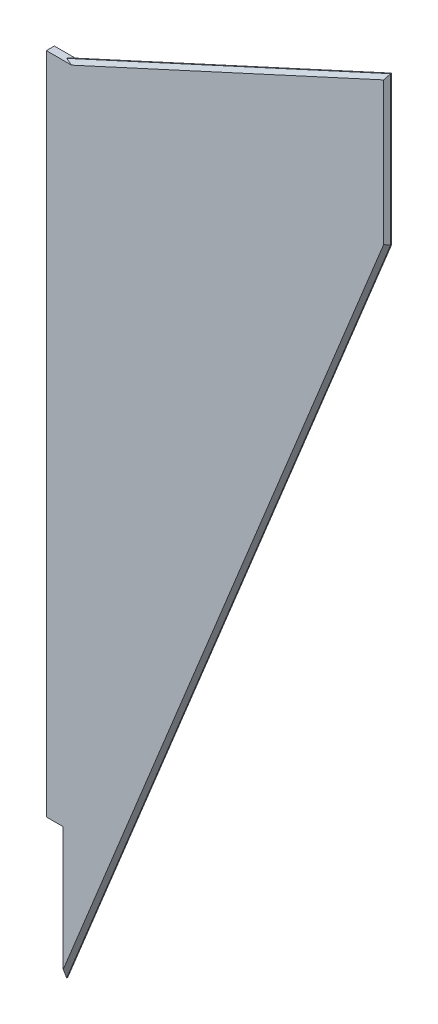
ISO-10303-21;
HEADER;
FILE_DESCRIPTION(('STEP AP214'),'2;1');
FILE_NAME('part.step','',(''),(''),'','','');
FILE_SCHEMA(('AUTOMOTIVE_DESIGN { 1 0 10303 214 1 1 1 1 }'));
ENDSEC;
DATA;
#1=APPLICATION_CONTEXT('core data for automotive mechanical design processes');
#2=APPLICATION_PROTOCOL_DEFINITION('international standard','automotive_design',2000,#1);
#3=PRODUCT_CONTEXT('',#1,'mechanical');
#4=PRODUCT('Part','Part','',(#3));
#5=PRODUCT_RELATED_PRODUCT_CATEGORY('part','',(#4));
#6=PRODUCT_DEFINITION_FORMATION('','',#4);
#7=PRODUCT_DEFINITION_CONTEXT('part definition',#1,'design');
#8=PRODUCT_DEFINITION('design','',#6,#7);
#9=PRODUCT_DEFINITION_SHAPE('','',#8);
#10=(LENGTH_UNIT() NAMED_UNIT(*) SI_UNIT(.MILLI.,.METRE.));
#11=(NAMED_UNIT(*) PLANE_ANGLE_UNIT() SI_UNIT($,.RADIAN.));
#12=(NAMED_UNIT(*) SI_UNIT($,.STERADIAN.) SOLID_ANGLE_UNIT());
#13=UNCERTAINTY_MEASURE_WITH_UNIT(LENGTH_MEASURE(1.E-05),#10,'distance_accuracy_value','');
#14=(GEOMETRIC_REPRESENTATION_CONTEXT(3) GLOBAL_UNCERTAINTY_ASSIGNED_CONTEXT((#13)) GLOBAL_UNIT_ASSIGNED_CONTEXT((#10,
#11,#12)) REPRESENTATION_CONTEXT('',''));
#15=CARTESIAN_POINT('',(0.,0.,0.));
#16=DIRECTION('',(0.,0.,1.));
#17=DIRECTION('',(1.,0.,0.));
#18=AXIS2_PLACEMENT_3D('',#15,#16,#17);
#19=CARTESIAN_POINT('',(59.9812470693966,2660.,3.));
#20=DIRECTION('',(1.,0.,0.));
#21=DIRECTION('',(0.,0.,-1.));
#22=AXIS2_PLACEMENT_3D('',#19,#20,#21);
#23=PLANE('',#22);
#24=DIRECTION('',(0.,-1.,0.));
#25=VECTOR('',#24,1.);
#26=CARTESIAN_POINT('',(59.9812470693966,2660.,0.));
#27=LINE('',#26,#25);
#28=CARTESIAN_POINT('',(59.9812470693966,2409.95388623622,0.));
#29=VERTEX_POINT('',#28);
#30=CARTESIAN_POINT('',(59.9812470693966,2363.40483206936,0.));
#31=VERTEX_POINT('',#30);
#32=EDGE_CURVE('E152',#29,#31,#27,.T.);
#33=ORIENTED_EDGE('',*,*,#32,.T.);
#34=DIRECTION('',(0.,0.935802545616209,-0.352524602855208));
#35=VECTOR('',#34,1.);
#36=CARTESIAN_POINT('',(59.9812470693966,2359.95388623622,1.29999999999991));
#37=LINE('',#36,#35);
#38=CARTESIAN_POINT('',(59.9812470693966,2359.95388623622,1.29999999999988));
#39=VERTEX_POINT('',#38);
#40=EDGE_CURVE('E200',#31,#39,#37,.F.);
#41=ORIENTED_EDGE('',*,*,#40,.T.);
#42=DIRECTION('',(0.,0.,-1.));
#43=VECTOR('',#42,1.);
#44=CARTESIAN_POINT('',(59.9812470693966,2359.95388623622,3.));
#45=LINE('',#44,#43);
#46=CARTESIAN_POINT('',(59.9812470693966,2359.95388623622,1.70000000000008));
#47=VERTEX_POINT('',#46);
#48=EDGE_CURVE('E179',#47,#39,#45,.T.);
#49=ORIENTED_EDGE('',*,*,#48,.F.);
#50=DIRECTION('',(0.,0.935802545616199,0.352524602855235));
#51=VECTOR('',#50,1.);
#52=CARTESIAN_POINT('',(59.9812470693967,569.087914954843,-672.934107644164));
#53=LINE('',#52,#51);
#54=CARTESIAN_POINT('',(59.9812470693966,2363.40483206936,3.));
#55=VERTEX_POINT('',#54);
#56=EDGE_CURVE('E197',#47,#55,#53,.T.);
#57=ORIENTED_EDGE('',*,*,#56,.T.);
#58=DIRECTION('',(0.,-1.,0.));
#59=VECTOR('',#58,1.);
#60=CARTESIAN_POINT('',(59.9812470693966,2660.,3.));
#61=LINE('',#60,#59);
#62=CARTESIAN_POINT('',(59.9812470693966,2409.95388623622,3.));
#63=VERTEX_POINT('',#62);
#64=EDGE_CURVE('E165',#63,#55,#61,.T.);
#65=ORIENTED_EDGE('',*,*,#64,.F.);
#66=DIRECTION('',(0.,0.,1.));
#67=VECTOR('',#66,1.);
#68=CARTESIAN_POINT('',(59.9812470693966,2409.95388623622,0.));
#69=LINE('',#68,#67);
#70=EDGE_CURVE('E146',#29,#63,#69,.T.);
#71=ORIENTED_EDGE('',*,*,#70,.F.);
#72=EDGE_LOOP('',(#33,#41,#49,#57,#65,#71));
#73=FACE_BOUND('',#72,.T.);
#74=ADVANCED_FACE('F40',(#73),#23,.F.);
#75=CARTESIAN_POINT('',(182.,2716.,3.));
#76=DIRECTION('',(0.417167660330651,-0.908829545720346,0.));
#77=DIRECTION('',(0.908829545720346,0.417167660330651,0.));
#78=AXIS2_PLACEMENT_3D('',#75,#76,#77);
#79=PLANE('',#78);
#80=DIRECTION('',(0.,0.,-1.));
#81=VECTOR('',#80,1.);
#82=CARTESIAN_POINT('',(182.,2716.,3.));
#83=LINE('',#82,#81);
#84=CARTESIAN_POINT('',(182.,2716.,1.69999999999981));
#85=VERTEX_POINT('',#84);
#86=CARTESIAN_POINT('',(182.,2716.,1.29999999999981));
#87=VERTEX_POINT('',#86);
#88=EDGE_CURVE('E168',#85,#87,#83,.T.);
#89=ORIENTED_EDGE('',*,*,#88,.T.);
#90=DIRECTION('',(-0.908829545720346,-0.417167660330651,0.));
#91=VECTOR('',#90,1.);
#92=CARTESIAN_POINT('',(182.,2716.,1.29999999999981));
#93=LINE('',#92,#91);
#94=CARTESIAN_POINT('',(60.,2660.,1.29999999999981));
#95=VERTEX_POINT('',#94);
#96=EDGE_CURVE('E210',#87,#95,#93,.T.);
#97=ORIENTED_EDGE('',*,*,#96,.T.);
#98=DIRECTION('',(0.,0.,-1.));
#99=VECTOR('',#98,1.);
#100=CARTESIAN_POINT('',(60.,2660.,3.));
#101=LINE('',#100,#99);
#102=CARTESIAN_POINT('',(60.,2660.,1.69999999999981));
#103=VERTEX_POINT('',#102);
#104=EDGE_CURVE('E183',#103,#95,#101,.T.);
#105=ORIENTED_EDGE('',*,*,#104,.F.);
#106=DIRECTION('',(0.908829545720346,0.417167660330651,0.));
#107=VECTOR('',#106,1.);
#108=CARTESIAN_POINT('',(182.,2716.,1.69999999999981));
#109=LINE('',#108,#107);
#110=EDGE_CURVE('E206',#103,#85,#109,.T.);
#111=ORIENTED_EDGE('',*,*,#110,.T.);
#112=EDGE_LOOP('',(#89,#97,#105,#111));
#113=FACE_BOUND('',#112,.T.);
#114=ADVANCED_FACE('F254',(#113),#79,.F.);
#115=CARTESIAN_POINT('',(60.,2660.,3.));
#116=DIRECTION('',(0.,-1.,0.));
#117=DIRECTION('',(0.,0.,-1.));
#118=AXIS2_PLACEMENT_3D('',#115,#116,#117);
#119=PLANE('',#118);
#120=DIRECTION('',(-1.,0.,0.));
#121=VECTOR('',#120,1.);
#122=CARTESIAN_POINT('',(60.,2660.,0.));
#123=LINE('',#122,#121);
#124=CARTESIAN_POINT('',(63.1162530647008,2660.,0.));
#125=VERTEX_POINT('',#124);
#126=CARTESIAN_POINT('',(53.6312470693966,2660.,0.));
#127=VERTEX_POINT('',#126);
#128=EDGE_CURVE('E154',#125,#127,#123,.T.);
#129=ORIENTED_EDGE('',*,*,#128,.T.);
#130=DIRECTION('',(0.,0.,-1.));
#131=VECTOR('',#130,1.);
#132=CARTESIAN_POINT('',(53.6312470693966,2660.,0.));
#133=LINE('',#132,#131);
#134=CARTESIAN_POINT('',(53.6312470693966,2660.,3.));
#135=VERTEX_POINT('',#134);
#136=EDGE_CURVE('E143',#135,#127,#133,.T.);
#137=ORIENTED_EDGE('',*,*,#136,.F.);
#138=DIRECTION('',(-1.,0.,0.));
#139=VECTOR('',#138,1.);
#140=CARTESIAN_POINT('',(60.,2660.,3.));
#141=LINE('',#140,#139);
#142=CARTESIAN_POINT('',(63.1162530647032,2660.,3.));
#143=VERTEX_POINT('',#142);
#144=EDGE_CURVE('E162',#143,#135,#141,.T.);
#145=ORIENTED_EDGE('',*,*,#144,.F.);
#146=DIRECTION('',(-0.922912682762478,0.,-0.385009324557425));
#147=VECTOR('',#146,1.);
#148=CARTESIAN_POINT('',(60.4619289852007,2660.,1.8927018339948));
#149=LINE('',#148,#147);
#150=EDGE_CURVE('E224',#143,#103,#149,.T.);
#151=ORIENTED_EDGE('',*,*,#150,.T.);
#152=ORIENTED_EDGE('',*,*,#104,.T.);
#153=DIRECTION('',(-0.922912682762414,0.,0.385009324557579));
#154=VECTOR('',#153,1.);
#155=CARTESIAN_POINT('',(59.3959390193528,2660.,1.55199470599352));
#156=LINE('',#155,#154);
#157=EDGE_CURVE('E220',#95,#125,#156,.F.);
#158=ORIENTED_EDGE('',*,*,#157,.T.);
#159=EDGE_LOOP('',(#129,#137,#145,#151,#152,#158));
#160=FACE_BOUND('',#159,.T.);
#161=ADVANCED_FACE('F282',(#160),#119,.F.);
#162=CARTESIAN_POINT('',(59.9812470693966,2359.95388623622,3.));
#163=DIRECTION('',(-0.926331929287375,0.376708317910197,0.));
#164=DIRECTION('',(-0.376708317910197,-0.926331929287375,0.));
#165=AXIS2_PLACEMENT_3D('',#162,#163,#164);
#166=PLANE('',#165);
#167=ORIENTED_EDGE('',*,*,#48,.T.);
#168=DIRECTION('',(0.376708317910197,0.926331929287375,0.));
#169=VECTOR('',#168,1.);
#170=CARTESIAN_POINT('',(59.9812470693966,2359.95388623622,1.29999999999988));
#171=LINE('',#170,#169);
#172=CARTESIAN_POINT('',(182.,2660.,1.29999999999988));
#173=VERTEX_POINT('',#172);
#174=EDGE_CURVE('E190',#39,#173,#171,.T.);
#175=ORIENTED_EDGE('',*,*,#174,.T.);
#176=DIRECTION('',(0.,0.,-1.));
#177=VECTOR('',#176,1.);
#178=CARTESIAN_POINT('',(182.,2660.,3.));
#179=LINE('',#178,#177);
#180=CARTESIAN_POINT('',(182.,2660.,1.70000000000008));
#181=VERTEX_POINT('',#180);
#182=EDGE_CURVE('E175',#181,#173,#179,.T.);
#183=ORIENTED_EDGE('',*,*,#182,.F.);
#184=DIRECTION('',(-0.376708317910197,-0.926331929287375,0.));
#185=VECTOR('',#184,1.);
#186=CARTESIAN_POINT('',(59.9812470693966,2359.95388623622,1.70000000000008));
#187=LINE('',#186,#185);
#188=EDGE_CURVE('E187',#181,#47,#187,.T.);
#189=ORIENTED_EDGE('',*,*,#188,.T.);
#190=EDGE_LOOP('',(#167,#175,#183,#189));
#191=FACE_BOUND('',#190,.T.);
#192=ADVANCED_FACE('F270',(#191),#166,.F.);
#193=CARTESIAN_POINT('',(182.,2660.,3.));
#194=DIRECTION('',(-1.,0.,0.));
#195=DIRECTION('',(0.,0.,1.));
#196=AXIS2_PLACEMENT_3D('',#193,#194,#195);
#197=PLANE('',#196);
#198=ORIENTED_EDGE('',*,*,#182,.T.);
#199=DIRECTION('',(0.,1.,0.));
#200=VECTOR('',#199,1.);
#201=CARTESIAN_POINT('',(182.,2660.,1.29999999999991));
#202=LINE('',#201,#200);
#203=EDGE_CURVE('E230',#173,#87,#202,.T.);
#204=ORIENTED_EDGE('',*,*,#203,.T.);
#205=ORIENTED_EDGE('',*,*,#88,.F.);
#206=DIRECTION('',(0.,-1.,0.));
#207=VECTOR('',#206,1.);
#208=CARTESIAN_POINT('',(182.,2663.45094583314,1.69999999999998));
#209=LINE('',#208,#207);
#210=EDGE_CURVE('E227',#85,#181,#209,.T.);
#211=ORIENTED_EDGE('',*,*,#210,.T.);
#212=EDGE_LOOP('',(#198,#204,#205,#211));
#213=FACE_BOUND('',#212,.T.);
#214=ADVANCED_FACE('F257',(#213),#197,.F.);
#215=CARTESIAN_POINT('',(0.,0.,3.));
#216=DIRECTION('',(0.,0.,1.));
#217=DIRECTION('',(1.,0.,0.));
#218=AXIS2_PLACEMENT_3D('',#215,#216,#217);
#219=PLANE('',#218);
#220=DIRECTION('',(0.376708317910197,0.926331929287375,0.));
#221=VECTOR('',#220,1.);
#222=CARTESIAN_POINT('',(180.795768491927,2660.48972081328,3.));
#223=LINE('',#222,#221);
#224=CARTESIAN_POINT('',(180.7,2660.25422452166,3.));
#225=VERTEX_POINT('',#224);
#226=EDGE_CURVE('E203',#55,#225,#223,.T.);
#227=ORIENTED_EDGE('',*,*,#226,.T.);
#228=DIRECTION('',(0.,1.,0.));
#229=VECTOR('',#228,1.);
#230=CARTESIAN_POINT('',(180.7,2714.56958875719,3.));
#231=LINE('',#230,#229);
#232=CARTESIAN_POINT('',(180.7,2713.97286744571,3.));
#233=VERTEX_POINT('',#232);
#234=EDGE_CURVE('E243',#225,#233,#231,.T.);
#235=ORIENTED_EDGE('',*,*,#234,.T.);
#236=DIRECTION('',(-0.908829545720346,-0.417167660330651,0.));
#237=VECTOR('',#236,1.);
#238=CARTESIAN_POINT('',(60.5423179584301,2658.81852159056,3.));
#239=LINE('',#238,#237);
#240=EDGE_CURVE('E217',#233,#143,#239,.T.);
#241=ORIENTED_EDGE('',*,*,#240,.T.);
#242=ORIENTED_EDGE('',*,*,#144,.T.);
#243=DIRECTION('',(0.,1.,0.));
#244=VECTOR('',#243,1.);
#245=CARTESIAN_POINT('',(53.6312470693966,2409.95388623622,3.));
#246=LINE('',#245,#244);
#247=CARTESIAN_POINT('',(53.6312470693966,2409.95388623622,3.));
#248=VERTEX_POINT('',#247);
#249=EDGE_CURVE('E136',#248,#135,#246,.T.);
#250=ORIENTED_EDGE('',*,*,#249,.F.);
#251=DIRECTION('',(1.,0.,0.));
#252=VECTOR('',#251,1.);
#253=CARTESIAN_POINT('',(53.6312470693966,2409.95388623622,3.));
#254=LINE('',#253,#252);
#255=EDGE_CURVE('E131',#248,#63,#254,.T.);
#256=ORIENTED_EDGE('',*,*,#255,.T.);
#257=ORIENTED_EDGE('',*,*,#64,.T.);
#258=EDGE_LOOP('',(#227,#235,#241,#242,#250,#256,#257));
#259=FACE_BOUND('',#258,.T.);
#260=ADVANCED_FACE('F261',(#259),#219,.T.);
#261=CARTESIAN_POINT('',(0.,0.,0.));
#262=DIRECTION('',(0.,0.,1.));
#263=DIRECTION('',(1.,0.,0.));
#264=AXIS2_PLACEMENT_3D('',#261,#262,#263);
#265=PLANE('',#264);
#266=DIRECTION('',(0.908829545720346,0.417167660330651,0.));
#267=VECTOR('',#266,1.);
#268=CARTESIAN_POINT('',(-997.513175937243,2173.15370472042,0.));
#269=LINE('',#268,#267);
#270=CARTESIAN_POINT('',(180.7,2713.97286744571,0.));
#271=VERTEX_POINT('',#270);
#272=EDGE_CURVE('E214',#125,#271,#269,.T.);
#273=ORIENTED_EDGE('',*,*,#272,.T.);
#274=DIRECTION('',(0.,-1.,0.));
#275=VECTOR('',#274,1.);
#276=CARTESIAN_POINT('',(180.7,0.,0.));
#277=LINE('',#276,#275);
#278=CARTESIAN_POINT('',(180.700000000001,2660.25422452166,0.));
#279=VERTEX_POINT('',#278);
#280=EDGE_CURVE('E237',#271,#279,#277,.T.);
#281=ORIENTED_EDGE('',*,*,#280,.T.);
#282=DIRECTION('',(-0.376708317910197,-0.926331929287375,0.));
#283=VECTOR('',#282,1.);
#284=CARTESIAN_POINT('',(-773.257166178754,314.457914246025,0.));
#285=LINE('',#284,#283);
#286=EDGE_CURVE('E194',#279,#31,#285,.T.);
#287=ORIENTED_EDGE('',*,*,#286,.T.);
#288=ORIENTED_EDGE('',*,*,#32,.F.);
#289=DIRECTION('',(1.,0.,0.));
#290=VECTOR('',#289,1.);
#291=CARTESIAN_POINT('',(53.6312470693966,2409.95388623622,0.));
#292=LINE('',#291,#290);
#293=CARTESIAN_POINT('',(53.6312470693966,2409.95388623622,0.));
#294=VERTEX_POINT('',#293);
#295=EDGE_CURVE('E129',#294,#29,#292,.T.);
#296=ORIENTED_EDGE('',*,*,#295,.F.);
#297=DIRECTION('',(0.,-1.,0.));
#298=VECTOR('',#297,1.);
#299=CARTESIAN_POINT('',(53.6312470693966,2409.95388623622,0.));
#300=LINE('',#299,#298);
#301=EDGE_CURVE('E137',#127,#294,#300,.T.);
#302=ORIENTED_EDGE('',*,*,#301,.F.);
#303=ORIENTED_EDGE('',*,*,#128,.F.);
#304=EDGE_LOOP('',(#273,#281,#287,#288,#296,#302,#303));
#305=FACE_BOUND('',#304,.T.);
#306=ADVANCED_FACE('F150',(#305),#265,.F.);
#307=CARTESIAN_POINT('',(53.6312470693966,2409.95388623622,0.));
#308=DIRECTION('',(0.,1.,0.));
#309=DIRECTION('',(0.,0.,1.));
#310=AXIS2_PLACEMENT_3D('',#307,#308,#309);
#311=PLANE('',#310);
#312=ORIENTED_EDGE('',*,*,#70,.T.);
#313=ORIENTED_EDGE('',*,*,#255,.F.);
#314=DIRECTION('',(0.,0.,1.));
#315=VECTOR('',#314,1.);
#316=CARTESIAN_POINT('',(53.6312470693966,2409.95388623622,0.));
#317=LINE('',#316,#315);
#318=EDGE_CURVE('E124',#294,#248,#317,.T.);
#319=ORIENTED_EDGE('',*,*,#318,.F.);
#320=ORIENTED_EDGE('',*,*,#295,.T.);
#321=EDGE_LOOP('',(#312,#313,#319,#320));
#322=FACE_BOUND('',#321,.T.);
#323=ADVANCED_FACE('F127',(#322),#311,.F.);
#324=CARTESIAN_POINT('',(53.6312470693966,0.,0.));
#325=DIRECTION('',(1.,0.,0.));
#326=DIRECTION('',(0.,0.,-1.));
#327=AXIS2_PLACEMENT_3D('',#324,#325,#326);
#328=PLANE('',#327);
#329=ORIENTED_EDGE('',*,*,#301,.T.);
#330=ORIENTED_EDGE('',*,*,#318,.T.);
#331=ORIENTED_EDGE('',*,*,#249,.T.);
#332=ORIENTED_EDGE('',*,*,#136,.T.);
#333=EDGE_LOOP('',(#329,#330,#331,#332));
#334=FACE_BOUND('',#333,.T.);
#335=ADVANCED_FACE('F141',(#334),#328,.F.);
#336=CARTESIAN_POINT('',(59.9812470693966,2359.95388623622,1.29999999999991));
#337=DIRECTION('',(-0.655015588828762,0.266373006123695,0.707106781186502));
#338=DIRECTION('',(0.376708317910197,0.926331929287375,0.));
#339=AXIS2_PLACEMENT_3D('',#336,#337,#338);
#340=PLANE('',#339);
#341=ORIENTED_EDGE('',*,*,#286,.F.);
#342=DIRECTION('',(0.700441800498495,-0.136976524371338,0.700441800498495));
#343=VECTOR('',#342,1.);
#344=CARTESIAN_POINT('',(150.92296547303,2666.07734172096,-29.77703452697));
#345=LINE('',#344,#343);
#346=EDGE_CURVE('E240',#279,#173,#345,.T.);
#347=ORIENTED_EDGE('',*,*,#346,.T.);
#348=ORIENTED_EDGE('',*,*,#174,.F.);
#349=ORIENTED_EDGE('',*,*,#40,.F.);
#350=EDGE_LOOP('',(#341,#347,#348,#349));
#351=FACE_BOUND('',#350,.T.);
#352=ADVANCED_FACE('F273',(#351),#340,.F.);
#353=CARTESIAN_POINT('',(-773.257166178754,314.457914246025,3.));
#354=DIRECTION('',(0.65501558882879,-0.266373006123707,0.707106781186472));
#355=DIRECTION('',(-0.376708317910197,-0.926331929287375,0.));
#356=AXIS2_PLACEMENT_3D('',#353,#354,#355);
#357=PLANE('',#356);
#358=ORIENTED_EDGE('',*,*,#188,.F.);
#359=DIRECTION('',(-0.700441800498511,0.136976524371182,0.700441800498511));
#360=VECTOR('',#359,1.);
#361=CARTESIAN_POINT('',(-62.2639631498405,2707.76760706969,245.963963149841));
#362=LINE('',#361,#360);
#363=EDGE_CURVE('E11',#181,#225,#362,.T.);
#364=ORIENTED_EDGE('',*,*,#363,.T.);
#365=ORIENTED_EDGE('',*,*,#226,.F.);
#366=ORIENTED_EDGE('',*,*,#56,.F.);
#367=EDGE_LOOP('',(#358,#364,#365,#366));
#368=FACE_BOUND('',#367,.T.);
#369=ADVANCED_FACE('F264',(#368),#357,.T.);
#370=CARTESIAN_POINT('',(182.,2716.,1.2999999999998));
#371=DIRECTION('',(0.294982081511568,-0.642639534721629,0.707106781186457));
#372=DIRECTION('',(-0.908829545720346,-0.417167660330651,0.));
#373=AXIS2_PLACEMENT_3D('',#370,#371,#372);
#374=PLANE('',#373);
#375=ORIENTED_EDGE('',*,*,#96,.F.);
#376=DIRECTION('',(-0.475032926004372,-0.740734391278986,-0.475032926004372));
#377=VECTOR('',#376,1.);
#378=CARTESIAN_POINT('',(182.,2716.,1.2999999999998));
#379=LINE('',#378,#377);
#380=EDGE_CURVE('E234',#87,#271,#379,.T.);
#381=ORIENTED_EDGE('',*,*,#380,.T.);
#382=ORIENTED_EDGE('',*,*,#272,.F.);
#383=ORIENTED_EDGE('',*,*,#157,.F.);
#384=EDGE_LOOP('',(#375,#381,#382,#383));
#385=FACE_BOUND('',#384,.T.);
#386=ADVANCED_FACE('F280',(#385),#374,.F.);
#387=CARTESIAN_POINT('',(-997.513175937242,2173.15370472042,3.));
#388=DIRECTION('',(-0.294982081511498,0.642639534721478,0.707106781186623));
#389=DIRECTION('',(0.908829545720346,0.417167660330651,0.));
#390=AXIS2_PLACEMENT_3D('',#387,#388,#389);
#391=PLANE('',#390);
#392=ORIENTED_EDGE('',*,*,#240,.F.);
#393=DIRECTION('',(0.475032926004286,0.740734391279096,-0.475032926004286));
#394=VECTOR('',#393,1.);
#395=CARTESIAN_POINT('',(-275.470986339731,2002.65051611359,459.170986339731));
#396=LINE('',#395,#394);
#397=EDGE_CURVE('E49',#233,#85,#396,.T.);
#398=ORIENTED_EDGE('',*,*,#397,.T.);
#399=ORIENTED_EDGE('',*,*,#110,.F.);
#400=ORIENTED_EDGE('',*,*,#150,.F.);
#401=EDGE_LOOP('',(#392,#398,#399,#400));
#402=FACE_BOUND('',#401,.T.);
#403=ADVANCED_FACE('F249',(#402),#391,.T.);
#404=CARTESIAN_POINT('',(182.,2660.,1.29999999999991));
#405=DIRECTION('',(-0.707106781186547,0.,0.707106781186547));
#406=DIRECTION('',(0.,1.,0.));
#407=AXIS2_PLACEMENT_3D('',#404,#405,#406);
#408=PLANE('',#407);
#409=ORIENTED_EDGE('',*,*,#346,.F.);
#410=ORIENTED_EDGE('',*,*,#280,.F.);
#411=ORIENTED_EDGE('',*,*,#380,.F.);
#412=ORIENTED_EDGE('',*,*,#203,.F.);
#413=EDGE_LOOP('',(#409,#410,#411,#412));
#414=FACE_BOUND('',#413,.T.);
#415=ADVANCED_FACE('F277',(#414),#408,.F.);
#416=CARTESIAN_POINT('',(180.7,0.,3.));
#417=DIRECTION('',(0.707106781186548,0.,0.707106781186548));
#418=DIRECTION('',(0.,-1.,0.));
#419=AXIS2_PLACEMENT_3D('',#416,#417,#418);
#420=PLANE('',#419);
#421=ORIENTED_EDGE('',*,*,#363,.F.);
#422=ORIENTED_EDGE('',*,*,#210,.F.);
#423=ORIENTED_EDGE('',*,*,#397,.F.);
#424=ORIENTED_EDGE('',*,*,#234,.F.);
#425=EDGE_LOOP('',(#421,#422,#423,#424));
#426=FACE_BOUND('',#425,.T.);
#427=ADVANCED_FACE('F42',(#426),#420,.T.);
#428=CLOSED_SHELL('',(#74,#114,#161,#192,#214,#260,#306,#323,#335,#352,#369,#386,#403,#415,#427));
#429=MANIFOLD_SOLID_BREP('B2',#428);
#430=ADVANCED_BREP_SHAPE_REPRESENTATION('',(#18,#429),#14);
#431=SHAPE_DEFINITION_REPRESENTATION(#9,#430);
ENDSEC;
END-ISO-10303-21;
